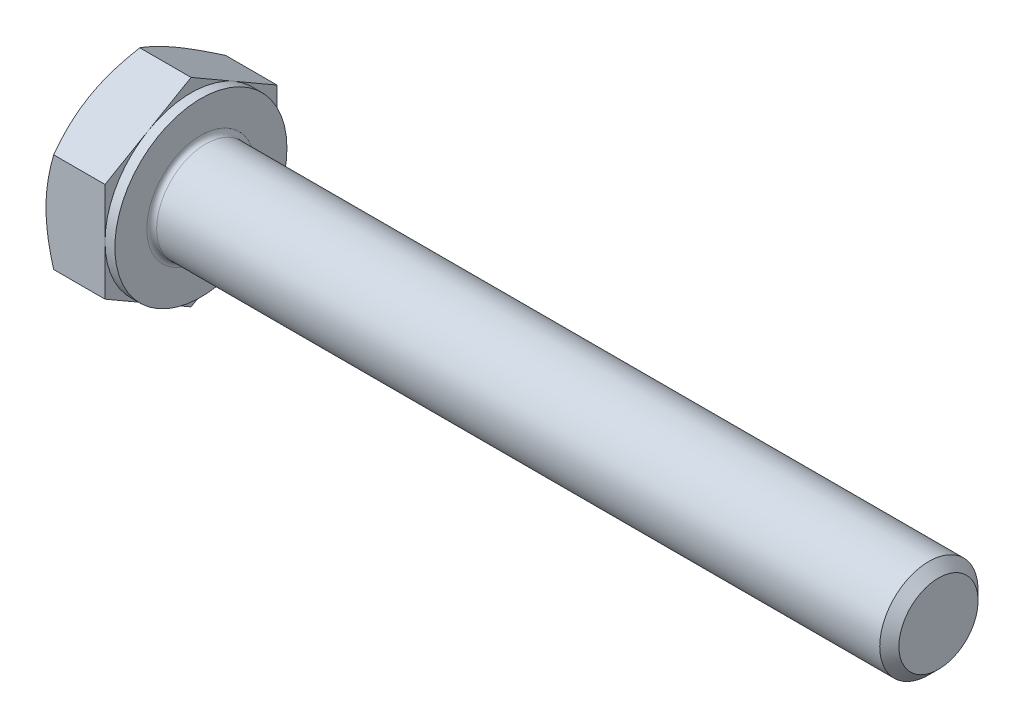
ISO-10303-21;
HEADER;
FILE_DESCRIPTION(('STEP AP214'),'2;1');
FILE_NAME('part.step','',(''),(''),'','','');
FILE_SCHEMA(('AUTOMOTIVE_DESIGN { 1 0 10303 214 1 1 1 1 }'));
ENDSEC;
DATA;
#1=APPLICATION_CONTEXT('core data for automotive mechanical design processes');
#2=APPLICATION_PROTOCOL_DEFINITION('international standard','automotive_design',2000,#1);
#3=PRODUCT_CONTEXT('',#1,'mechanical');
#4=PRODUCT('Part','Part','',(#3));
#5=PRODUCT_RELATED_PRODUCT_CATEGORY('part','',(#4));
#6=PRODUCT_DEFINITION_FORMATION('','',#4);
#7=PRODUCT_DEFINITION_CONTEXT('part definition',#1,'design');
#8=PRODUCT_DEFINITION('design','',#6,#7);
#9=PRODUCT_DEFINITION_SHAPE('','',#8);
#10=(LENGTH_UNIT() NAMED_UNIT(*) SI_UNIT(.MILLI.,.METRE.));
#11=(NAMED_UNIT(*) PLANE_ANGLE_UNIT() SI_UNIT($,.RADIAN.));
#12=(NAMED_UNIT(*) SI_UNIT($,.STERADIAN.) SOLID_ANGLE_UNIT());
#13=UNCERTAINTY_MEASURE_WITH_UNIT(LENGTH_MEASURE(1.E-05),#10,'distance_accuracy_value','');
#14=(GEOMETRIC_REPRESENTATION_CONTEXT(3) GLOBAL_UNCERTAINTY_ASSIGNED_CONTEXT((#13)) GLOBAL_UNIT_ASSIGNED_CONTEXT((#10,
#11,#12)) REPRESENTATION_CONTEXT('',''));
#15=CARTESIAN_POINT('',(0.,0.,0.));
#16=DIRECTION('',(0.,0.,1.));
#17=DIRECTION('',(1.,0.,0.));
#18=AXIS2_PLACEMENT_3D('',#15,#16,#17);
#19=CARTESIAN_POINT('',(2.8,4.04145188432738,0.));
#20=DIRECTION('',(1.,0.,0.));
#21=DIRECTION('',(0.,0.,-1.));
#22=AXIS2_PLACEMENT_3D('',#19,#20,#21);
#23=PLANE('',#22);
#24=CARTESIAN_POINT('',(2.8,0.,0.));
#25=DIRECTION('',(1.,0.,0.));
#26=DIRECTION('',(0.,0.,-1.));
#27=AXIS2_PLACEMENT_3D('',#24,#25,#26);
#28=CIRCLE('',#27,2.2);
#29=CARTESIAN_POINT('',(2.8,0.,-2.2));
#30=VERTEX_POINT('',#29);
#31=EDGE_CURVE('E44',#30,#30,#28,.F.);
#32=ORIENTED_EDGE('',*,*,#31,.T.);
#33=EDGE_LOOP('',(#32));
#34=FACE_BOUND('',#33,.T.);
#35=CARTESIAN_POINT('',(2.8,0.,0.));
#36=DIRECTION('',(1.,0.,0.));
#37=DIRECTION('',(0.,0.,-1.));
#38=AXIS2_PLACEMENT_3D('',#35,#36,#37);
#39=CIRCLE('',#38,3.5);
#40=CARTESIAN_POINT('',(2.8,0.,-3.5));
#41=VERTEX_POINT('',#40);
#42=EDGE_CURVE('E295',#41,#41,#39,.T.);
#43=ORIENTED_EDGE('',*,*,#42,.T.);
#44=EDGE_LOOP('',(#43));
#45=FACE_BOUND('',#44,.T.);
#46=ADVANCED_FACE('F36',(#34,#45),#23,.T.);
#47=CARTESIAN_POINT('',(0.,0.,0.));
#48=DIRECTION('',(-1.,0.,0.));
#49=DIRECTION('',(0.,0.,1.));
#50=AXIS2_PLACEMENT_3D('',#47,#48,#49);
#51=CYLINDRICAL_SURFACE('',#50,2.);
#52=CARTESIAN_POINT('',(3.,0.,0.));
#53=DIRECTION('',(1.,0.,0.));
#54=DIRECTION('',(0.,0.,-1.));
#55=AXIS2_PLACEMENT_3D('',#52,#53,#54);
#56=CIRCLE('',#55,2.);
#57=CARTESIAN_POINT('',(3.,0.,-2.));
#58=VERTEX_POINT('',#57);
#59=EDGE_CURVE('E11',#58,#58,#56,.T.);
#60=ORIENTED_EDGE('',*,*,#59,.T.);
#61=EDGE_LOOP('',(#60));
#62=FACE_BOUND('',#61,.T.);
#63=CARTESIAN_POINT('',(32.41,0.,0.));
#64=DIRECTION('',(-1.,0.,0.));
#65=DIRECTION('',(0.,0.,1.));
#66=AXIS2_PLACEMENT_3D('',#63,#64,#65);
#67=CIRCLE('',#66,2.);
#68=CARTESIAN_POINT('',(32.41,0.,2.));
#69=VERTEX_POINT('',#68);
#70=EDGE_CURVE('E274',#69,#69,#67,.T.);
#71=ORIENTED_EDGE('',*,*,#70,.T.);
#72=EDGE_LOOP('',(#71));
#73=FACE_BOUND('',#72,.T.);
#74=ADVANCED_FACE('F248',(#62,#73),#51,.T.);
#75=CARTESIAN_POINT('',(32.8,0.,0.));
#76=DIRECTION('',(-1.,0.,0.));
#77=DIRECTION('',(0.,0.,1.));
#78=AXIS2_PLACEMENT_3D('',#75,#76,#77);
#79=CONICAL_SURFACE('',#78,1.61,0.785398163397438);
#80=ORIENTED_EDGE('',*,*,#70,.F.);
#81=EDGE_LOOP('',(#80));
#82=FACE_BOUND('',#81,.T.);
#83=CARTESIAN_POINT('',(32.8,0.,0.));
#84=DIRECTION('',(-1.,0.,0.));
#85=DIRECTION('',(0.,0.,1.));
#86=AXIS2_PLACEMENT_3D('',#83,#84,#85);
#87=CIRCLE('',#86,1.61);
#88=CARTESIAN_POINT('',(32.8,0.,1.61));
#89=VERTEX_POINT('',#88);
#90=EDGE_CURVE('E272',#89,#89,#87,.T.);
#91=ORIENTED_EDGE('',*,*,#90,.T.);
#92=EDGE_LOOP('',(#91));
#93=FACE_BOUND('',#92,.T.);
#94=ADVANCED_FACE('F253',(#82,#93),#79,.T.);
#95=CARTESIAN_POINT('',(32.8,0.,0.));
#96=DIRECTION('',(-1.,0.,0.));
#97=DIRECTION('',(0.,0.,1.));
#98=AXIS2_PLACEMENT_3D('',#95,#96,#97);
#99=PLANE('',#98);
#100=ORIENTED_EDGE('',*,*,#90,.F.);
#101=EDGE_LOOP('',(#100));
#102=FACE_BOUND('',#101,.T.);
#103=ADVANCED_FACE('F260',(#102),#99,.F.);
#104=CARTESIAN_POINT('',(2.4,3.5,0.));
#105=DIRECTION('',(1.,0.,0.));
#106=DIRECTION('',(0.,0.,-1.));
#107=AXIS2_PLACEMENT_3D('',#104,#105,#106);
#108=PLANE('',#107);
#109=DIRECTION('',(0.,0.500000000000001,0.866025403784438));
#110=VECTOR('',#109,1.);
#111=CARTESIAN_POINT('',(2.4,2.02072594216369,-3.5));
#112=LINE('',#111,#110);
#113=CARTESIAN_POINT('',(2.4,2.02072594216369,-3.5));
#114=VERTEX_POINT('',#113);
#115=CARTESIAN_POINT('',(2.4,3.03108891324553,-1.75));
#116=VERTEX_POINT('',#115);
#117=EDGE_CURVE('E168',#114,#116,#112,.T.);
#118=ORIENTED_EDGE('',*,*,#117,.T.);
#119=CARTESIAN_POINT('',(2.4,0.,0.));
#120=DIRECTION('',(-1.,0.,0.));
#121=DIRECTION('',(0.,0.,1.));
#122=AXIS2_PLACEMENT_3D('',#119,#120,#121);
#123=CIRCLE('',#122,3.5);
#124=CARTESIAN_POINT('',(2.4,0.,-3.5));
#125=VERTEX_POINT('',#124);
#126=EDGE_CURVE('E51',#116,#125,#123,.T.);
#127=ORIENTED_EDGE('',*,*,#126,.T.);
#128=DIRECTION('',(0.,1.,0.));
#129=VECTOR('',#128,1.);
#130=CARTESIAN_POINT('',(2.4,2.02072594216369,-3.5));
#131=LINE('',#130,#129);
#132=EDGE_CURVE('E298',#125,#114,#131,.T.);
#133=ORIENTED_EDGE('',*,*,#132,.T.);
#134=EDGE_LOOP('',(#118,#127,#133));
#135=FACE_BOUND('',#134,.T.);
#136=ADVANCED_FACE('F263',(#135),#108,.T.);
#137=CARTESIAN_POINT('',(2.4,4.04145188432738,0.));
#138=VERTEX_POINT('',#137);
#139=EDGE_CURVE('E166',#116,#138,#112,.T.);
#140=ORIENTED_EDGE('',*,*,#139,.T.);
#141=DIRECTION('',(0.,-0.500000000000001,0.866025403784438));
#142=VECTOR('',#141,1.);
#143=CARTESIAN_POINT('',(2.4,4.04145188432738,0.));
#144=LINE('',#143,#142);
#145=CARTESIAN_POINT('',(2.4,3.03108891324553,1.75));
#146=VERTEX_POINT('',#145);
#147=EDGE_CURVE('E165',#138,#146,#144,.T.);
#148=ORIENTED_EDGE('',*,*,#147,.T.);
#149=EDGE_CURVE('E154',#146,#116,#123,.T.);
#150=ORIENTED_EDGE('',*,*,#149,.T.);
#151=EDGE_LOOP('',(#140,#148,#150));
#152=FACE_BOUND('',#151,.T.);
#153=ADVANCED_FACE('F268',(#152),#108,.T.);
#154=CARTESIAN_POINT('',(2.4,2.02072594216369,3.5));
#155=VERTEX_POINT('',#154);
#156=EDGE_CURVE('E133',#146,#155,#144,.T.);
#157=ORIENTED_EDGE('',*,*,#156,.T.);
#158=DIRECTION('',(0.,-1.,0.));
#159=VECTOR('',#158,1.);
#160=CARTESIAN_POINT('',(2.4,2.02072594216369,3.5));
#161=LINE('',#160,#159);
#162=CARTESIAN_POINT('',(2.4,0.,3.5));
#163=VERTEX_POINT('',#162);
#164=EDGE_CURVE('E127',#155,#163,#161,.T.);
#165=ORIENTED_EDGE('',*,*,#164,.T.);
#166=EDGE_CURVE('E131',#163,#146,#123,.T.);
#167=ORIENTED_EDGE('',*,*,#166,.T.);
#168=EDGE_LOOP('',(#157,#165,#167));
#169=FACE_BOUND('',#168,.T.);
#170=ADVANCED_FACE('F129',(#169),#108,.T.);
#171=CARTESIAN_POINT('',(2.4,-2.0207259421637,3.5));
#172=VERTEX_POINT('',#171);
#173=EDGE_CURVE('E137',#163,#172,#161,.T.);
#174=ORIENTED_EDGE('',*,*,#173,.T.);
#175=DIRECTION('',(0.,-0.500000000000001,-0.866025403784438));
#176=VECTOR('',#175,1.);
#177=CARTESIAN_POINT('',(2.4,-4.04145188432739,0.));
#178=LINE('',#177,#176);
#179=CARTESIAN_POINT('',(2.4,-3.03108891324553,1.75));
#180=VERTEX_POINT('',#179);
#181=EDGE_CURVE('E144',#172,#180,#178,.T.);
#182=ORIENTED_EDGE('',*,*,#181,.T.);
#183=EDGE_CURVE('E141',#180,#163,#123,.T.);
#184=ORIENTED_EDGE('',*,*,#183,.T.);
#185=EDGE_LOOP('',(#174,#182,#184));
#186=FACE_BOUND('',#185,.T.);
#187=ADVANCED_FACE('F142',(#186),#108,.T.);
#188=CARTESIAN_POINT('',(2.4,-4.04145188432739,0.));
#189=VERTEX_POINT('',#188);
#190=EDGE_CURVE('E160',#180,#189,#178,.T.);
#191=ORIENTED_EDGE('',*,*,#190,.T.);
#192=DIRECTION('',(0.,0.500000000000001,-0.866025403784438));
#193=VECTOR('',#192,1.);
#194=CARTESIAN_POINT('',(2.4,-2.0207259421637,-3.5));
#195=LINE('',#194,#193);
#196=CARTESIAN_POINT('',(2.4,-3.03108891324553,-1.75));
#197=VERTEX_POINT('',#196);
#198=EDGE_CURVE('E336',#189,#197,#195,.T.);
#199=ORIENTED_EDGE('',*,*,#198,.T.);
#200=EDGE_CURVE('E148',#197,#180,#123,.T.);
#201=ORIENTED_EDGE('',*,*,#200,.T.);
#202=EDGE_LOOP('',(#191,#199,#201));
#203=FACE_BOUND('',#202,.T.);
#204=ADVANCED_FACE('F337',(#203),#108,.T.);
#205=CARTESIAN_POINT('',(2.4,-2.0207259421637,-3.5));
#206=VERTEX_POINT('',#205);
#207=EDGE_CURVE('E155',#197,#206,#195,.T.);
#208=ORIENTED_EDGE('',*,*,#207,.T.);
#209=EDGE_CURVE('E299',#206,#125,#131,.T.);
#210=ORIENTED_EDGE('',*,*,#209,.T.);
#211=EDGE_CURVE('E306',#125,#197,#123,.T.);
#212=ORIENTED_EDGE('',*,*,#211,.T.);
#213=EDGE_LOOP('',(#208,#210,#212));
#214=FACE_BOUND('',#213,.T.);
#215=ADVANCED_FACE('F269',(#214),#108,.T.);
#216=CARTESIAN_POINT('',(0.,0.,0.));
#217=DIRECTION('',(-1.,0.,0.));
#218=DIRECTION('',(0.,0.,1.));
#219=AXIS2_PLACEMENT_3D('',#216,#217,#218);
#220=CYLINDRICAL_SURFACE('',#219,3.5);
#221=ORIENTED_EDGE('',*,*,#126,.F.);
#222=ORIENTED_EDGE('',*,*,#149,.F.);
#223=ORIENTED_EDGE('',*,*,#166,.F.);
#224=ORIENTED_EDGE('',*,*,#183,.F.);
#225=ORIENTED_EDGE('',*,*,#200,.F.);
#226=ORIENTED_EDGE('',*,*,#211,.F.);
#227=EDGE_LOOP('',(#221,#222,#223,#224,#225,#226));
#228=FACE_BOUND('',#227,.T.);
#229=ORIENTED_EDGE('',*,*,#42,.F.);
#230=EDGE_LOOP('',(#229));
#231=FACE_BOUND('',#230,.T.);
#232=ADVANCED_FACE('F151',(#228,#231),#220,.T.);
#233=CARTESIAN_POINT('',(0.,4.04145188432738,0.));
#234=DIRECTION('',(1.,0.,0.));
#235=DIRECTION('',(0.,0.,-1.));
#236=AXIS2_PLACEMENT_3D('',#233,#234,#235);
#237=PLANE('',#236);
#238=CARTESIAN_POINT('',(0.,0.,0.));
#239=DIRECTION('',(1.,0.,0.));
#240=DIRECTION('',(0.,0.,-1.));
#241=AXIS2_PLACEMENT_3D('',#238,#239,#240);
#242=CIRCLE('',#241,3.5);
#243=CARTESIAN_POINT('',(0.,0.,-3.5));
#244=VERTEX_POINT('',#243);
#245=CARTESIAN_POINT('',(0.,3.03108891324553,-1.75));
#246=VERTEX_POINT('',#245);
#247=EDGE_CURVE('E294',#244,#246,#242,.T.);
#248=ORIENTED_EDGE('',*,*,#247,.F.);
#249=CARTESIAN_POINT('',(0.,-3.03108891324553,-1.75));
#250=VERTEX_POINT('',#249);
#251=EDGE_CURVE('E290',#250,#244,#242,.T.);
#252=ORIENTED_EDGE('',*,*,#251,.F.);
#253=CARTESIAN_POINT('',(0.,-3.03108891324553,1.75));
#254=VERTEX_POINT('',#253);
#255=EDGE_CURVE('E293',#254,#250,#242,.T.);
#256=ORIENTED_EDGE('',*,*,#255,.F.);
#257=CARTESIAN_POINT('',(0.,0.,3.5));
#258=VERTEX_POINT('',#257);
#259=EDGE_CURVE('E329',#258,#254,#242,.T.);
#260=ORIENTED_EDGE('',*,*,#259,.F.);
#261=CARTESIAN_POINT('',(0.,0.,0.));
#262=DIRECTION('',(-1.,0.,0.));
#263=DIRECTION('',(0.,0.,1.));
#264=AXIS2_PLACEMENT_3D('',#261,#262,#263);
#265=CIRCLE('',#264,3.5);
#266=CARTESIAN_POINT('',(0.,3.03108891324553,1.75));
#267=VERTEX_POINT('',#266);
#268=EDGE_CURVE('E169',#258,#267,#265,.T.);
#269=ORIENTED_EDGE('',*,*,#268,.T.);
#270=EDGE_CURVE('E352',#246,#267,#242,.T.);
#271=ORIENTED_EDGE('',*,*,#270,.F.);
#272=EDGE_LOOP('',(#248,#252,#256,#260,#269,#271));
#273=FACE_BOUND('',#272,.T.);
#274=ADVANCED_FACE('F198',(#273),#237,.F.);
#275=CARTESIAN_POINT('',(0.,0.,0.));
#276=DIRECTION('',(1.,0.,0.));
#277=DIRECTION('',(0.,0.,-1.));
#278=AXIS2_PLACEMENT_3D('',#275,#276,#277);
#279=CONICAL_SURFACE('',#278,3.5,1.0471975511966);
#280=CARTESIAN_POINT('',(0.312674060693369,2.02061047210985,3.5002));
#281=CARTESIAN_POINT('',(0.261385788989981,2.10941108799267,3.34639282154755));
#282=CARTESIAN_POINT('',(0.214740953816195,2.19897822522909,3.19125798916558));
#283=CARTESIAN_POINT('',(0.133321875533348,2.37966345361545,2.87830199342322));
#284=CARTESIAN_POINT('',(0.0985764355845606,2.47078475532382,2.72047526921251));
#285=CARTESIAN_POINT('',(0.0444900271828356,2.65189807961073,2.40677778961987));
#286=CARTESIAN_POINT('',(0.0247890862603812,2.74186223545399,2.25095530083931));
#287=CARTESIAN_POINT('',(0.0012701327372542,2.92221386641055,1.93857711279463));
#288=CARTESIAN_POINT('',(-0.00256735545443482,3.01260068598001,1.78202254896577));
#289=CARTESIAN_POINT('',(0.00541530187697773,3.1814939814933,1.48949078007901));
#290=CARTESIAN_POINT('',(0.0152754340696072,3.26002573814993,1.3534697875421));
#291=CARTESIAN_POINT('',(0.0465264668994037,3.41657761679354,1.08231397971101));
#292=CARTESIAN_POINT('',(0.0679280432857984,3.49459719728458,0.947180102315319));
#293=CARTESIAN_POINT('',(0.121430407880577,3.65147186489429,0.675465207594817));
#294=CARTESIAN_POINT('',(0.153757994445087,3.73030709667644,0.538918580721665));
#295=CARTESIAN_POINT('',(0.227128933807994,3.88680174018324,0.267861907055499));
#296=CARTESIAN_POINT('',(0.268155046569867,3.96446315689009,0.133348387531464));
#297=CARTESIAN_POINT('',(0.312674060693371,4.04156735438122,-0.000200000000000201));
#298=B_SPLINE_CURVE_WITH_KNOTS('',3,(#280,#281,#282,#283,#284,#285,#286,#287,#288,#289,#290,
#291,#292,#293,#294,#295,#296,#297),.UNSPECIFIED.,.F.,.F.,(4,2,2,2,2,2,2,2,4),(0.,
0.554793832886253,1.11092123814984,1.65328467083219,2.19498204478403,2.6666513085086,
3.13875761298267,3.6213361260051,4.10296698719187),.UNSPECIFIED.);
#299=CARTESIAN_POINT('',(0.312607391169643,4.04145188432738,0.));
#300=VERTEX_POINT('',#299);
#301=EDGE_CURVE('E217',#267,#300,#298,.T.);
#302=ORIENTED_EDGE('',*,*,#301,.T.);
#303=CARTESIAN_POINT('',(0.312674060693371,4.04156735438122,0.000199999999999895));
#304=CARTESIAN_POINT('',(0.261385788989984,3.9527667384984,-0.15360717845245));
#305=CARTESIAN_POINT('',(0.214740953816197,3.86319960126198,-0.308742010834424));
#306=CARTESIAN_POINT('',(0.133321875533349,3.68251437287562,-0.621698006576781));
#307=CARTESIAN_POINT('',(0.0985764355845619,3.59139307116725,-0.779524730787496));
#308=CARTESIAN_POINT('',(0.0444900271828364,3.41027974688034,-1.09322221038013));
#309=CARTESIAN_POINT('',(0.0247890862603818,3.32031559103708,-1.24904469916069));
#310=CARTESIAN_POINT('',(0.00127013273725429,3.13996396008052,-1.56142288720537));
#311=CARTESIAN_POINT('',(-0.00256735545443505,3.04957714051106,-1.71797745103423));
#312=CARTESIAN_POINT('',(0.00541530187697722,2.88068384499777,-2.01050921992099));
#313=CARTESIAN_POINT('',(0.0152754340696067,2.80215208834114,-2.14653021245791));
#314=CARTESIAN_POINT('',(0.0465264668994028,2.64560020969753,-2.41768602028899));
#315=CARTESIAN_POINT('',(0.0679280432857971,2.56758062920649,-2.55281989768468));
#316=CARTESIAN_POINT('',(0.121430407880576,2.41070596159678,-2.82453479240518));
#317=CARTESIAN_POINT('',(0.153757994445085,2.33187072981463,-2.96108141927834));
#318=CARTESIAN_POINT('',(0.227128933807992,2.17537608630783,-3.2321380929445));
#319=CARTESIAN_POINT('',(0.268155046569865,2.09771466960098,-3.36665161246854));
#320=CARTESIAN_POINT('',(0.312674060693368,2.02061047210985,-3.5002));
#321=B_SPLINE_CURVE_WITH_KNOTS('',3,(#303,#304,#305,#306,#307,#308,#309,#310,#311,#312,#313,
#314,#315,#316,#317,#318,#319,#320),.UNSPECIFIED.,.F.,.F.,(4,2,2,2,2,2,2,2,4),(0.,
0.554793832886254,1.11092123814984,1.65328467083219,2.19498204478403,2.6666513085086,
3.13875761298267,3.6213361260051,4.10296698719187),.UNSPECIFIED.);
#322=EDGE_CURVE('E59',#300,#246,#321,.T.);
#323=ORIENTED_EDGE('',*,*,#322,.T.);
#324=ORIENTED_EDGE('',*,*,#270,.T.);
#325=EDGE_LOOP('',(#302,#323,#324));
#326=FACE_BOUND('',#325,.T.);
#327=ADVANCED_FACE('F353',(#326),#279,.T.);
#328=CARTESIAN_POINT('',(1.74876972324083,-5.51155991662167,3.5));
#329=CARTESIAN_POINT('',(1.6739233606435,-5.35795146497443,3.5));
#330=CARTESIAN_POINT('',(1.59977092634847,-5.20399921327068,3.5));
#331=CARTESIAN_POINT('',(1.45324265223558,-4.89522455167779,3.5));
#332=CARTESIAN_POINT('',(1.38086707701141,-4.74040201636208,3.5));
#333=CARTESIAN_POINT('',(1.23793493399994,-4.4289461529424,3.5));
#334=CARTESIAN_POINT('',(1.1673897119315,-4.27230760071022,3.5));
#335=CARTESIAN_POINT('',(1.02907715201446,-3.95781335407225,3.5));
#336=CARTESIAN_POINT('',(0.9613096882058,-3.79995771524291,3.5));
#337=CARTESIAN_POINT('',(0.827049258068265,-3.4774111334268,3.5));
#338=CARTESIAN_POINT('',(0.760677040301393,-3.3126696619141,3.5));
#339=CARTESIAN_POINT('',(0.632756391222601,-2.98129055334351,3.5));
#340=CARTESIAN_POINT('',(0.571208489240971,-2.81465271050398,3.5));
#341=CARTESIAN_POINT('',(0.454490935593631,-2.47950135142084,3.5));
#342=CARTESIAN_POINT('',(0.399309072522248,-2.3109921296124,3.5));
#343=CARTESIAN_POINT('',(0.297038623207368,-1.97155788075463,3.5));
#344=CARTESIAN_POINT('',(0.249947575461083,-1.80063360563483,3.5));
#345=CARTESIAN_POINT('',(0.166312731904446,-1.45721769442351,3.5));
#346=CARTESIAN_POINT('',(0.129709932809731,-1.28474069132431,3.5));
#347=CARTESIAN_POINT('',(0.069066443790598,-0.937557024710317,3.5));
#348=CARTESIAN_POINT('',(0.0450243877823832,-0.762850605780841,3.5));
#349=CARTESIAN_POINT('',(0.0117307990577607,-0.414396255839323,3.5));
#350=CARTESIAN_POINT('',(0.00228260576824221,-0.240667591359061,3.5));
#351=CARTESIAN_POINT('',(-0.00154556657178774,0.106974361978117,3.5));
#352=CARTESIAN_POINT('',(0.00407467653682719,0.280887653519264,3.5));
#353=CARTESIAN_POINT('',(0.025816005675724,0.573677732069624,3.5));
#354=CARTESIAN_POINT('',(0.0381294865222867,0.692856455403475,3.5));
#355=CARTESIAN_POINT('',(0.0691104276210827,0.93039057267218,3.5));
#356=CARTESIAN_POINT('',(0.0877786805228833,1.04874586201748,3.5));
#357=CARTESIAN_POINT('',(0.152339395828373,1.40238821330865,3.5));
#358=CARTESIAN_POINT('',(0.206777964761842,1.63613518289362,3.5));
#359=CARTESIAN_POINT('',(0.301818253779736,1.9858404099606,3.5));
#360=CARTESIAN_POINT('',(0.336200478121234,2.10359260845122,3.5));
#361=CARTESIAN_POINT('',(0.40869422617953,2.33795453185625,3.5));
#362=CARTESIAN_POINT('',(0.446805778664188,2.45456424794997,3.5));
#363=CARTESIAN_POINT('',(0.526133501179593,2.68667648799218,3.5));
#364=CARTESIAN_POINT('',(0.567348797905202,2.80217931315365,3.5));
#365=CARTESIAN_POINT('',(0.652383319257555,3.03221622488002,3.5));
#366=CARTESIAN_POINT('',(0.696202484064562,3.14675033363065,3.5));
#367=CARTESIAN_POINT('',(0.817586420524252,3.45518824791985,3.5));
#368=CARTESIAN_POINT('',(0.897216284270024,3.64827858653487,3.5));
#369=CARTESIAN_POINT('',(1.06116121789352,4.03246734047174,3.5));
#370=CARTESIAN_POINT('',(1.1454768097731,4.22356553103576,3.5));
#371=CARTESIAN_POINT('',(1.31768022516433,4.60422080385887,3.5));
#372=CARTESIAN_POINT('',(1.40556928969842,4.79377732281036,3.5));
#373=CARTESIAN_POINT('',(1.5840729434937,5.17160543290685,3.5));
#374=CARTESIAN_POINT('',(1.67468761675268,5.35987698423189,3.5));
#375=CARTESIAN_POINT('',(1.85818750995007,5.73567568482784,3.5));
#376=CARTESIAN_POINT('',(1.95107608308063,5.92320119337956,3.5));
#377=CARTESIAN_POINT('',(2.13854805180964,6.29740401627919,3.5));
#378=CARTESIAN_POINT('',(2.23313146548459,6.48408132155384,3.5));
#379=CARTESIAN_POINT('',(2.51886265052555,7.04299370869452,3.5));
#380=CARTESIAN_POINT('',(2.71203324279836,7.41419418882236,3.5));
#381=CARTESIAN_POINT('',(3.08131090922904,8.11545297659332,3.5));
#382=CARTESIAN_POINT('',(3.25705680052901,8.44570240889787,3.5));
#383=CARTESIAN_POINT('',(3.61066708174042,9.10509095555402,3.5));
#384=CARTESIAN_POINT('',(3.78853160254258,9.43422999967597,3.5));
#385=CARTESIAN_POINT('',(4.14522643287859,10.0905480477554,3.5));
#386=CARTESIAN_POINT('',(4.32405147354836,10.4177299197431,3.5));
#387=CARTESIAN_POINT('',(4.68290305461309,11.0714005829853,3.5));
#388=CARTESIAN_POINT('',(4.8629294985335,11.3978894271807,3.5));
#389=CARTESIAN_POINT('',(5.04339321876769,11.7241348746726,3.5));
#390=B_SPLINE_CURVE_WITH_KNOTS('',3,(#328,#329,#330,#331,#332,#333,#334,#335,#336,#337,#338,
#339,#340,#341,#342,#343,#344,#345,#346,#347,#348,#349,#350,#351,#352,#353,#354,#355,#356,#357,
#358,#359,#360,#361,#362,#363,#364,#365,#366,#367,#368,#369,#370,#371,#372,#373,#374,#375,#376,
#377,#378,#379,#380,#381,#382,#383,#384,#385,#386,#387,#388,#389),.UNSPECIFIED.,.F.,.F.,(4,2,2,
2,2,2,2,2,2,2,2,2,2,2,2,2,2,2,2,2,2,2,2,2,2,2,2,2,2,2,4),(0.,0.512624455455559,1.02532478887103,
1.54067716699585,2.05600615007007,2.58877526866933,3.12160276180877,3.65339055960882,
4.18501628177853,4.71358975001966,5.24210571958899,5.76343550668359,6.28477297996433,
6.64403977825953,7.00335140539849,7.72232402673616,8.09029790450667,8.45827462103385,
8.82614818350625,9.19401329793224,9.82051720822947,10.4470910530887,11.0738843896344,
11.7006970625238,12.3284975533834,12.9563047441025,14.211635085947,15.3339292662801,
16.4562931462709,17.574877685398,18.6933734561263),.UNSPECIFIED.);
#391=CARTESIAN_POINT('',(0.312607391169641,2.02072594216369,3.5));
#392=VERTEX_POINT('',#391);
#393=EDGE_CURVE('E229',#258,#392,#390,.T.);
#394=ORIENTED_EDGE('',*,*,#393,.T.);
#395=EDGE_CURVE('E228',#392,#267,#298,.T.);
#396=ORIENTED_EDGE('',*,*,#395,.T.);
#397=ORIENTED_EDGE('',*,*,#268,.F.);
#398=EDGE_LOOP('',(#394,#396,#397));
#399=FACE_BOUND('',#398,.T.);
#400=ADVANCED_FACE('F323',(#399),#279,.T.);
#401=CARTESIAN_POINT('',(0.312607391169643,-2.0207259421637,3.5));
#402=VERTEX_POINT('',#401);
#403=EDGE_CURVE('E275',#402,#258,#390,.T.);
#404=ORIENTED_EDGE('',*,*,#403,.T.);
#405=ORIENTED_EDGE('',*,*,#259,.T.);
#406=CARTESIAN_POINT('',(0.312674060693376,-4.04156735438123,-0.000200000000000035));
#407=CARTESIAN_POINT('',(0.261385788989988,-3.95276673849841,0.15360717845245));
#408=CARTESIAN_POINT('',(0.214740953816202,-3.86319960126199,0.308742010834424));
#409=CARTESIAN_POINT('',(0.133321875533354,-3.68251437287563,0.621698006576782));
#410=CARTESIAN_POINT('',(0.0985764355845664,-3.59139307116726,0.779524730787497));
#411=CARTESIAN_POINT('',(0.0444900271828409,-3.41027974688034,1.09322221038013));
#412=CARTESIAN_POINT('',(0.0247890862603861,-3.32031559103709,1.24904469916069));
#413=CARTESIAN_POINT('',(0.00127013273725842,-3.13996396008052,1.56142288720538));
#414=CARTESIAN_POINT('',(-0.00256735545443098,-3.04957714051107,1.71797745103423));
#415=CARTESIAN_POINT('',(0.00541530187698127,-2.88068384499778,2.01050921992099));
#416=CARTESIAN_POINT('',(0.0152754340696107,-2.80215208834115,2.14653021245791));
#417=CARTESIAN_POINT('',(0.0465264668994066,-2.64560020969754,2.417686020289));
#418=CARTESIAN_POINT('',(0.0679280432858008,-2.5675806292065,2.55281989768468));
#419=CARTESIAN_POINT('',(0.121430407880579,-2.41070596159679,2.82453479240518));
#420=CARTESIAN_POINT('',(0.153757994445088,-2.33187072981464,2.96108141927834));
#421=CARTESIAN_POINT('',(0.227128933807995,-2.17537608630783,3.2321380929445));
#422=CARTESIAN_POINT('',(0.268155046569867,-2.09771466960099,3.36665161246854));
#423=CARTESIAN_POINT('',(0.312674060693371,-2.02061047210986,3.5002));
#424=B_SPLINE_CURVE_WITH_KNOTS('',3,(#406,#407,#408,#409,#410,#411,#412,#413,#414,#415,#416,
#417,#418,#419,#420,#421,#422,#423),.UNSPECIFIED.,.F.,.F.,(4,2,2,2,2,2,2,2,4),(0.,
0.554793832886255,1.11092123814984,1.65328467083219,2.19498204478404,2.6666513085086,
3.13875761298268,3.6213361260051,4.10296698719187),.UNSPECIFIED.);
#425=EDGE_CURVE('E219',#254,#402,#424,.T.);
#426=ORIENTED_EDGE('',*,*,#425,.T.);
#427=EDGE_LOOP('',(#404,#405,#426));
#428=FACE_BOUND('',#427,.T.);
#429=ADVANCED_FACE('F187',(#428),#279,.T.);
#430=CARTESIAN_POINT('',(0.312607391169648,-4.04145188432739,0.));
#431=VERTEX_POINT('',#430);
#432=EDGE_CURVE('E212',#431,#254,#424,.T.);
#433=ORIENTED_EDGE('',*,*,#432,.T.);
#434=ORIENTED_EDGE('',*,*,#255,.T.);
#435=CARTESIAN_POINT('',(0.312674060693371,-2.02061047210986,-3.5002));
#436=CARTESIAN_POINT('',(0.261385788989984,-2.10941108799268,-3.34639282154755));
#437=CARTESIAN_POINT('',(0.214740953816198,-2.1989782252291,-3.19125798916558));
#438=CARTESIAN_POINT('',(0.133321875533351,-2.37966345361546,-2.87830199342322));
#439=CARTESIAN_POINT('',(0.0985764355845638,-2.47078475532383,-2.7204752692125));
#440=CARTESIAN_POINT('',(0.0444900271828391,-2.65189807961074,-2.40677778961987));
#441=CARTESIAN_POINT('',(0.0247890862603849,-2.741862235454,-2.25095530083931));
#442=CARTESIAN_POINT('',(0.00127013273725832,-2.92221386641056,-1.93857711279463));
#443=CARTESIAN_POINT('',(-0.00256735545443053,-3.01260068598002,-1.78202254896577));
#444=CARTESIAN_POINT('',(0.00541530187698254,-3.18149398149331,-1.48949078007901));
#445=CARTESIAN_POINT('',(0.0152754340696123,-3.26002573814994,-1.35346978754209));
#446=CARTESIAN_POINT('',(0.0465264668994089,-3.41657761679355,-1.08231397971101));
#447=CARTESIAN_POINT('',(0.0679280432858033,-3.49459719728458,-0.947180102315317));
#448=CARTESIAN_POINT('',(0.121430407880582,-3.6514718648943,-0.675465207594816));
#449=CARTESIAN_POINT('',(0.153757994445092,-3.73030709667645,-0.538918580721665));
#450=CARTESIAN_POINT('',(0.227128933808,-3.88680174018325,-0.267861907055499));
#451=CARTESIAN_POINT('',(0.268155046569872,-3.9644631568901,-0.133348387531464));
#452=CARTESIAN_POINT('',(0.312674060693376,-4.04156735438123,0.00020000000000001));
#453=B_SPLINE_CURVE_WITH_KNOTS('',3,(#435,#436,#437,#438,#439,#440,#441,#442,#443,#444,#445,
#446,#447,#448,#449,#450,#451,#452),.UNSPECIFIED.,.F.,.F.,(4,2,2,2,2,2,2,2,4),(0.,
0.554793832886254,1.11092123814984,1.65328467083219,2.19498204478403,2.6666513085086,
3.13875761298267,3.6213361260051,4.10296698719187),.UNSPECIFIED.);
#454=EDGE_CURVE('E218',#250,#431,#453,.T.);
#455=ORIENTED_EDGE('',*,*,#454,.T.);
#456=EDGE_LOOP('',(#433,#434,#455));
#457=FACE_BOUND('',#456,.T.);
#458=ADVANCED_FACE('F351',(#457),#279,.T.);
#459=CARTESIAN_POINT('',(0.312607391169641,2.02072594216369,-3.5));
#460=VERTEX_POINT('',#459);
#461=EDGE_CURVE('E220',#246,#460,#321,.T.);
#462=ORIENTED_EDGE('',*,*,#461,.T.);
#463=CARTESIAN_POINT('',(1.74876972324083,-5.51155991662167,-3.5));
#464=CARTESIAN_POINT('',(1.6739233606435,-5.35795146497443,-3.5));
#465=CARTESIAN_POINT('',(1.59977092634847,-5.20399921327068,-3.5));
#466=CARTESIAN_POINT('',(1.45324265223558,-4.8952245516778,-3.5));
#467=CARTESIAN_POINT('',(1.38086707701141,-4.74040201636208,-3.5));
#468=CARTESIAN_POINT('',(1.23793493399994,-4.4289461529424,-3.5));
#469=CARTESIAN_POINT('',(1.1673897119315,-4.27230760071022,-3.5));
#470=CARTESIAN_POINT('',(1.02907715201446,-3.95781335407225,-3.5));
#471=CARTESIAN_POINT('',(0.9613096882058,-3.79995771524291,-3.5));
#472=CARTESIAN_POINT('',(0.827049258068265,-3.4774111334268,-3.5));
#473=CARTESIAN_POINT('',(0.760677040301393,-3.3126696619141,-3.5));
#474=CARTESIAN_POINT('',(0.632756391222601,-2.98129055334352,-3.5));
#475=CARTESIAN_POINT('',(0.571208489240971,-2.81465271050398,-3.5));
#476=CARTESIAN_POINT('',(0.454490935593631,-2.47950135142085,-3.5));
#477=CARTESIAN_POINT('',(0.399309072522248,-2.3109921296124,-3.5));
#478=CARTESIAN_POINT('',(0.297038623207368,-1.97155788075463,-3.5));
#479=CARTESIAN_POINT('',(0.249947575461084,-1.80063360563483,-3.5));
#480=CARTESIAN_POINT('',(0.166312731904447,-1.45721769442351,-3.5));
#481=CARTESIAN_POINT('',(0.129709932809731,-1.28474069132431,-3.5));
#482=CARTESIAN_POINT('',(0.0690664437905979,-0.937557024710318,-3.5));
#483=CARTESIAN_POINT('',(0.0450243877823831,-0.762850605780842,-3.5));
#484=CARTESIAN_POINT('',(0.0117307990577608,-0.414396255839325,-3.5));
#485=CARTESIAN_POINT('',(0.00228260576824233,-0.240667591359063,-3.5));
#486=CARTESIAN_POINT('',(-0.00154556657178786,0.106974361978115,-3.5));
#487=CARTESIAN_POINT('',(0.00407467653682683,0.280887653519262,-3.5));
#488=CARTESIAN_POINT('',(0.0258160056757238,0.573677732069623,-3.5));
#489=CARTESIAN_POINT('',(0.0381294865222867,0.692856455403474,-3.5));
#490=CARTESIAN_POINT('',(0.0691104276210826,0.930390572672179,-3.5));
#491=CARTESIAN_POINT('',(0.087778680522883,1.04874586201748,-3.5));
#492=CARTESIAN_POINT('',(0.152339395828372,1.40238821330865,-3.5));
#493=CARTESIAN_POINT('',(0.206777964761842,1.63613518289362,-3.5));
#494=CARTESIAN_POINT('',(0.301818253779735,1.9858404099606,-3.5));
#495=CARTESIAN_POINT('',(0.336200478121233,2.10359260845121,-3.5));
#496=CARTESIAN_POINT('',(0.408694226179529,2.33795453185624,-3.5));
#497=CARTESIAN_POINT('',(0.446805778664186,2.45456424794997,-3.5));
#498=CARTESIAN_POINT('',(0.526133501179592,2.68667648799218,-3.5));
#499=CARTESIAN_POINT('',(0.567348797905201,2.80217931315364,-3.5));
#500=CARTESIAN_POINT('',(0.652383319257554,3.03221622488002,-3.5));
#501=CARTESIAN_POINT('',(0.69620248406456,3.14675033363064,-3.5));
#502=CARTESIAN_POINT('',(0.81758642052425,3.45518824791985,-3.5));
#503=CARTESIAN_POINT('',(0.897216284270023,3.64827858653487,-3.5));
#504=CARTESIAN_POINT('',(1.06116121789352,4.03246734047173,-3.5));
#505=CARTESIAN_POINT('',(1.1454768097731,4.22356553103576,-3.5));
#506=CARTESIAN_POINT('',(1.31768022516432,4.60422080385886,-3.5));
#507=CARTESIAN_POINT('',(1.40556928969841,4.79377732281036,-3.5));
#508=CARTESIAN_POINT('',(1.58407294349369,5.17160543290685,-3.5));
#509=CARTESIAN_POINT('',(1.67468761675268,5.35987698423189,-3.5));
#510=CARTESIAN_POINT('',(1.85818750995007,5.73567568482784,-3.5));
#511=CARTESIAN_POINT('',(1.95107608308063,5.92320119337956,-3.5));
#512=CARTESIAN_POINT('',(2.13854805180964,6.29740401627919,-3.5));
#513=CARTESIAN_POINT('',(2.23313146548459,6.48408132155384,-3.5));
#514=CARTESIAN_POINT('',(2.51886265052555,7.04299370869451,-3.5));
#515=CARTESIAN_POINT('',(2.71203324279836,7.41419418882235,-3.5));
#516=CARTESIAN_POINT('',(3.08131090922903,8.11545297659332,-3.5));
#517=CARTESIAN_POINT('',(3.257056800529,8.44570240889787,-3.5));
#518=CARTESIAN_POINT('',(3.61066708174042,9.10509095555402,-3.5));
#519=CARTESIAN_POINT('',(3.78853160254258,9.43422999967597,-3.5));
#520=CARTESIAN_POINT('',(4.14522643287858,10.0905480477554,-3.5));
#521=CARTESIAN_POINT('',(4.32405147354835,10.4177299197431,-3.5));
#522=CARTESIAN_POINT('',(4.68290305461308,11.0714005829853,-3.5));
#523=CARTESIAN_POINT('',(4.8629294985335,11.3978894271807,-3.5));
#524=CARTESIAN_POINT('',(5.04339321876769,11.7241348746726,-3.5));
#525=B_SPLINE_CURVE_WITH_KNOTS('',3,(#463,#464,#465,#466,#467,#468,#469,#470,#471,#472,#473,
#474,#475,#476,#477,#478,#479,#480,#481,#482,#483,#484,#485,#486,#487,#488,#489,#490,#491,#492,
#493,#494,#495,#496,#497,#498,#499,#500,#501,#502,#503,#504,#505,#506,#507,#508,#509,#510,#511,
#512,#513,#514,#515,#516,#517,#518,#519,#520,#521,#522,#523,#524),.UNSPECIFIED.,.F.,.F.,(4,2,2,
2,2,2,2,2,2,2,2,2,2,2,2,2,2,2,2,2,2,2,2,2,2,2,2,2,2,2,4),(0.,0.51262445545556,1.02532478887103,
1.54067716699585,2.05600615007008,2.58877526866933,3.12160276180877,3.65339055960882,
4.18501628177853,4.71358975001967,5.24210571958899,5.76343550668359,6.28477297996433,
6.64403977825953,7.00335140539849,7.72232402673616,8.09029790450666,8.45827462103385,
8.82614818350625,9.19401329793224,9.82051720822946,10.4470910530887,11.0738843896344,
11.7006970625238,12.3284975533834,12.9563047441025,14.211635085947,15.3339292662801,
16.4562931462709,17.574877685398,18.6933734561263),.UNSPECIFIED.);
#526=EDGE_CURVE('E180',#460,#244,#525,.F.);
#527=ORIENTED_EDGE('',*,*,#526,.T.);
#528=ORIENTED_EDGE('',*,*,#247,.T.);
#529=EDGE_LOOP('',(#462,#527,#528));
#530=FACE_BOUND('',#529,.T.);
#531=ADVANCED_FACE('F348',(#530),#279,.T.);
#532=CARTESIAN_POINT('',(0.312607391169536,-2.02072594216386,-3.5));
#533=VERTEX_POINT('',#532);
#534=EDGE_CURVE('E181',#533,#250,#453,.T.);
#535=ORIENTED_EDGE('',*,*,#534,.T.);
#536=ORIENTED_EDGE('',*,*,#251,.T.);
#537=EDGE_CURVE('E172',#244,#533,#525,.F.);
#538=ORIENTED_EDGE('',*,*,#537,.T.);
#539=EDGE_LOOP('',(#535,#536,#538));
#540=FACE_BOUND('',#539,.T.);
#541=ADVANCED_FACE('F196',(#540),#279,.T.);
#542=CARTESIAN_POINT('',(2.8,2.02072594216369,-3.5));
#543=DIRECTION('',(0.,0.,1.));
#544=DIRECTION('',(0.,-1.,0.));
#545=AXIS2_PLACEMENT_3D('',#542,#543,#544);
#546=PLANE('',#545);
#547=ORIENTED_EDGE('',*,*,#209,.F.);
#548=DIRECTION('',(-1.,0.,0.));
#549=VECTOR('',#548,1.);
#550=CARTESIAN_POINT('',(2.8,-2.0207259421637,-3.5));
#551=LINE('',#550,#549);
#552=EDGE_CURVE('E281',#206,#533,#551,.T.);
#553=ORIENTED_EDGE('',*,*,#552,.T.);
#554=ORIENTED_EDGE('',*,*,#537,.F.);
#555=ORIENTED_EDGE('',*,*,#526,.F.);
#556=DIRECTION('',(-1.,0.,0.));
#557=VECTOR('',#556,1.);
#558=CARTESIAN_POINT('',(2.8,2.02072594216369,-3.5));
#559=LINE('',#558,#557);
#560=EDGE_CURVE('E277',#114,#460,#559,.T.);
#561=ORIENTED_EDGE('',*,*,#560,.F.);
#562=ORIENTED_EDGE('',*,*,#132,.F.);
#563=EDGE_LOOP('',(#547,#553,#554,#555,#561,#562));
#564=FACE_BOUND('',#563,.T.);
#565=ADVANCED_FACE('F191',(#564),#546,.F.);
#566=CARTESIAN_POINT('',(2.8,-2.0207259421637,-3.5));
#567=DIRECTION('',(0.,0.866025403784438,0.500000000000001));
#568=DIRECTION('',(0.,-0.500000000000001,0.866025403784438));
#569=AXIS2_PLACEMENT_3D('',#566,#567,#568);
#570=PLANE('',#569);
#571=ORIENTED_EDGE('',*,*,#198,.F.);
#572=DIRECTION('',(-1.,0.,0.));
#573=VECTOR('',#572,1.);
#574=CARTESIAN_POINT('',(2.8,-4.04145188432739,0.));
#575=LINE('',#574,#573);
#576=EDGE_CURVE('E283',#189,#431,#575,.T.);
#577=ORIENTED_EDGE('',*,*,#576,.T.);
#578=ORIENTED_EDGE('',*,*,#454,.F.);
#579=ORIENTED_EDGE('',*,*,#534,.F.);
#580=ORIENTED_EDGE('',*,*,#552,.F.);
#581=ORIENTED_EDGE('',*,*,#207,.F.);
#582=EDGE_LOOP('',(#571,#577,#578,#579,#580,#581));
#583=FACE_BOUND('',#582,.T.);
#584=ADVANCED_FACE('F195',(#583),#570,.F.);
#585=CARTESIAN_POINT('',(2.8,-4.04145188432739,0.));
#586=DIRECTION('',(0.,0.866025403784438,-0.500000000000001));
#587=DIRECTION('',(0.,0.500000000000001,0.866025403784438));
#588=AXIS2_PLACEMENT_3D('',#585,#586,#587);
#589=PLANE('',#588);
#590=ORIENTED_EDGE('',*,*,#181,.F.);
#591=DIRECTION('',(-1.,0.,0.));
#592=VECTOR('',#591,1.);
#593=CARTESIAN_POINT('',(2.8,-2.0207259421637,3.5));
#594=LINE('',#593,#592);
#595=EDGE_CURVE('E159',#172,#402,#594,.T.);
#596=ORIENTED_EDGE('',*,*,#595,.T.);
#597=ORIENTED_EDGE('',*,*,#425,.F.);
#598=ORIENTED_EDGE('',*,*,#432,.F.);
#599=ORIENTED_EDGE('',*,*,#576,.F.);
#600=ORIENTED_EDGE('',*,*,#190,.F.);
#601=EDGE_LOOP('',(#590,#596,#597,#598,#599,#600));
#602=FACE_BOUND('',#601,.T.);
#603=ADVANCED_FACE('F203',(#602),#589,.F.);
#604=CARTESIAN_POINT('',(2.8,2.02072594216369,3.5));
#605=DIRECTION('',(0.,0.,-1.));
#606=DIRECTION('',(0.,1.,0.));
#607=AXIS2_PLACEMENT_3D('',#604,#605,#606);
#608=PLANE('',#607);
#609=ORIENTED_EDGE('',*,*,#164,.F.);
#610=DIRECTION('',(-1.,0.,0.));
#611=VECTOR('',#610,1.);
#612=CARTESIAN_POINT('',(2.8,2.02072594216369,3.5));
#613=LINE('',#612,#611);
#614=EDGE_CURVE('E286',#155,#392,#613,.T.);
#615=ORIENTED_EDGE('',*,*,#614,.T.);
#616=ORIENTED_EDGE('',*,*,#393,.F.);
#617=ORIENTED_EDGE('',*,*,#403,.F.);
#618=ORIENTED_EDGE('',*,*,#595,.F.);
#619=ORIENTED_EDGE('',*,*,#173,.F.);
#620=EDGE_LOOP('',(#609,#615,#616,#617,#618,#619));
#621=FACE_BOUND('',#620,.T.);
#622=ADVANCED_FACE('F157',(#621),#608,.F.);
#623=CARTESIAN_POINT('',(2.8,4.04145188432738,0.));
#624=DIRECTION('',(0.,-0.866025403784438,-0.500000000000001));
#625=DIRECTION('',(0.,0.500000000000001,-0.866025403784438));
#626=AXIS2_PLACEMENT_3D('',#623,#624,#625);
#627=PLANE('',#626);
#628=ORIENTED_EDGE('',*,*,#147,.F.);
#629=DIRECTION('',(-1.,0.,0.));
#630=VECTOR('',#629,1.);
#631=CARTESIAN_POINT('',(2.8,4.04145188432738,0.));
#632=LINE('',#631,#630);
#633=EDGE_CURVE('E288',#138,#300,#632,.T.);
#634=ORIENTED_EDGE('',*,*,#633,.T.);
#635=ORIENTED_EDGE('',*,*,#301,.F.);
#636=ORIENTED_EDGE('',*,*,#395,.F.);
#637=ORIENTED_EDGE('',*,*,#614,.F.);
#638=ORIENTED_EDGE('',*,*,#156,.F.);
#639=EDGE_LOOP('',(#628,#634,#635,#636,#637,#638));
#640=FACE_BOUND('',#639,.T.);
#641=ADVANCED_FACE('F234',(#640),#627,.F.);
#642=CARTESIAN_POINT('',(2.8,2.02072594216369,-3.5));
#643=DIRECTION('',(0.,-0.866025403784438,0.500000000000001));
#644=DIRECTION('',(0.,-0.500000000000001,-0.866025403784438));
#645=AXIS2_PLACEMENT_3D('',#642,#643,#644);
#646=PLANE('',#645);
#647=ORIENTED_EDGE('',*,*,#117,.F.);
#648=ORIENTED_EDGE('',*,*,#560,.T.);
#649=ORIENTED_EDGE('',*,*,#461,.F.);
#650=ORIENTED_EDGE('',*,*,#322,.F.);
#651=ORIENTED_EDGE('',*,*,#633,.F.);
#652=ORIENTED_EDGE('',*,*,#139,.F.);
#653=EDGE_LOOP('',(#647,#648,#649,#650,#651,#652));
#654=FACE_BOUND('',#653,.T.);
#655=ADVANCED_FACE('F237',(#654),#646,.F.);
#656=CARTESIAN_POINT('',(3.,0.,0.));
#657=DIRECTION('',(1.,0.,0.));
#658=DIRECTION('',(0.,0.,-1.));
#659=AXIS2_PLACEMENT_3D('',#656,#657,#658);
#660=TOROIDAL_SURFACE('',#659,2.2,0.2);
#661=ORIENTED_EDGE('',*,*,#59,.F.);
#662=EDGE_LOOP('',(#661));
#663=FACE_BOUND('',#662,.T.);
#664=ORIENTED_EDGE('',*,*,#31,.F.);
#665=EDGE_LOOP('',(#664));
#666=FACE_BOUND('',#665,.T.);
#667=ADVANCED_FACE('F38',(#663,#666),#660,.F.);
#668=CLOSED_SHELL('',(#46,#74,#94,#103,#136,#153,#170,#187,#204,#215,#232,#274,#327,#400,#429,
#458,#531,#541,#565,#584,#603,#622,#641,#655,#667));
#669=MANIFOLD_SOLID_BREP('B2',#668);
#670=ADVANCED_BREP_SHAPE_REPRESENTATION('',(#18,#669),#14);
#671=SHAPE_DEFINITION_REPRESENTATION(#9,#670);
ENDSEC;
END-ISO-10303-21;
